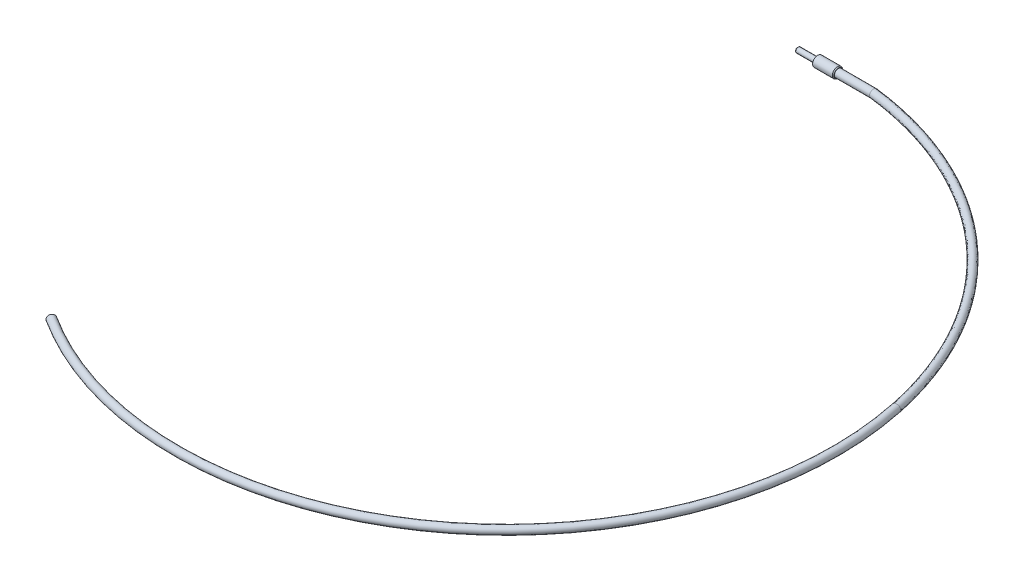
ISO-10303-21;
HEADER;
FILE_DESCRIPTION(('STEP AP214'),'2;1');
FILE_NAME('part.step','',(''),(''),'','','');
FILE_SCHEMA(('AUTOMOTIVE_DESIGN { 1 0 10303 214 1 1 1 1 }'));
ENDSEC;
DATA;
#1=APPLICATION_CONTEXT('core data for automotive mechanical design processes');
#2=APPLICATION_PROTOCOL_DEFINITION('international standard','automotive_design',2000,#1);
#3=PRODUCT_CONTEXT('',#1,'mechanical');
#4=PRODUCT('Part','Part','',(#3));
#5=PRODUCT_RELATED_PRODUCT_CATEGORY('part','',(#4));
#6=PRODUCT_DEFINITION_FORMATION('','',#4);
#7=PRODUCT_DEFINITION_CONTEXT('part definition',#1,'design');
#8=PRODUCT_DEFINITION('design','',#6,#7);
#9=PRODUCT_DEFINITION_SHAPE('','',#8);
#10=(LENGTH_UNIT() NAMED_UNIT(*) SI_UNIT(.MILLI.,.METRE.));
#11=(NAMED_UNIT(*) PLANE_ANGLE_UNIT() SI_UNIT($,.RADIAN.));
#12=(NAMED_UNIT(*) SI_UNIT($,.STERADIAN.) SOLID_ANGLE_UNIT());
#13=UNCERTAINTY_MEASURE_WITH_UNIT(LENGTH_MEASURE(1.E-05),#10,'distance_accuracy_value','');
#14=(GEOMETRIC_REPRESENTATION_CONTEXT(3) GLOBAL_UNCERTAINTY_ASSIGNED_CONTEXT((#13)) GLOBAL_UNIT_ASSIGNED_CONTEXT((#10,
#11,#12)) REPRESENTATION_CONTEXT('',''));
#15=CARTESIAN_POINT('',(0.,0.,0.));
#16=DIRECTION('',(0.,0.,1.));
#17=DIRECTION('',(1.,0.,0.));
#18=AXIS2_PLACEMENT_3D('',#15,#16,#17);
#19=CARTESIAN_POINT('',(-111.436989642943,0.,175.047081609406));
#20=DIRECTION('',(-0.842678132396547,0.,-0.538417649395586));
#21=DIRECTION('',(-0.538417649395586,0.,0.842678132396547));
#22=AXIS2_PLACEMENT_3D('',#19,#20,#21);
#23=PLANE('',#22);
#24=CARTESIAN_POINT('',(-111.436989642943,0.,175.047081609406));
#25=DIRECTION('',(-0.842678132396547,0.,-0.538417649395586));
#26=DIRECTION('',(-0.538417649395586,0.,0.842678132396547));
#27=AXIS2_PLACEMENT_3D('',#24,#25,#26);
#28=CIRCLE('',#27,2.413);
#29=CARTESIAN_POINT('',(-112.736191430934,0.,177.080463942879));
#30=VERTEX_POINT('',#29);
#31=EDGE_CURVE('E45',#30,#30,#28,.T.);
#32=ORIENTED_EDGE('',*,*,#31,.T.);
#33=EDGE_LOOP('',(#32));
#34=FACE_BOUND('',#33,.T.);
#35=ADVANCED_FACE('F32',(#34),#23,.T.);
#36=CARTESIAN_POINT('',(-2.0305232857597,0.,3.81488510642766));
#37=DIRECTION('',(0.,-1.,0.));
#38=DIRECTION('',(0.,0.,-1.));
#39=AXIS2_PLACEMENT_3D('',#36,#37,#38);
#40=TOROIDAL_SURFACE('',#39,203.2,2.413);
#41=ORIENTED_EDGE('',*,*,#31,.F.);
#42=EDGE_LOOP('',(#41));
#43=FACE_BOUND('',#42,.T.);
#44=CARTESIAN_POINT('',(196.869297150107,0.,-37.7675803156707));
#45=DIRECTION('',(0.204638117234736,0.,0.978837698995407));
#46=DIRECTION('',(0.978837698995407,0.,-0.204638117234736));
#47=AXIS2_PLACEMENT_3D('',#44,#45,#46);
#48=CIRCLE('',#47,2.413);
#49=CARTESIAN_POINT('',(199.231232517783,0.,-38.2613720925581));
#50=VERTEX_POINT('',#49);
#51=EDGE_CURVE('E63',#50,#50,#48,.T.);
#52=ORIENTED_EDGE('',*,*,#51,.T.);
#53=EDGE_LOOP('',(#52));
#54=FACE_BOUND('',#53,.T.);
#55=ADVANCED_FACE('F133',(#43,#54),#40,.T.);
#56=CARTESIAN_POINT('',(21.857688216756,0.,-201.488777882145));
#57=CARTESIAN_POINT('',(21.9454223642169,0.,-201.477811113712));
#58=CARTESIAN_POINT('',(22.0326396265489,0.,-201.466909065983));
#59=CARTESIAN_POINT('',(24.7619458079161,0.,-201.12574238947));
#60=CARTESIAN_POINT('',(27.4274088712571,0.,-200.740264373094));
#61=CARTESIAN_POINT('',(32.7104806856669,0.,-199.870777582429));
#62=CARTESIAN_POINT('',(35.3435578931917,0.,-199.384838118311));
#63=CARTESIAN_POINT('',(43.2115632831059,0.,-197.774517735688));
#64=CARTESIAN_POINT('',(48.4152551838274,0.,-196.497555292911));
#65=CARTESIAN_POINT('',(63.8544629871432,0.,-192.067953592542));
#66=CARTESIAN_POINT('',(73.9172372669281,0.,-188.315622142871));
#67=CARTESIAN_POINT('',(103.057190673557,0.,-174.794446888511));
#68=CARTESIAN_POINT('',(121.072175932676,0.,-162.745837636303));
#69=CARTESIAN_POINT('',(152.571261804763,0.,-133.721684173501));
#70=CARTESIAN_POINT('',(166.050531050647,0.,-116.750591725168));
#71=CARTESIAN_POINT('',(187.190864551694,0.,-79.4990119669768));
#72=CARTESIAN_POINT('',(194.848487659606,0.,-59.2251883660467));
#73=CARTESIAN_POINT('',(199.231232517783,0.,-38.2613720925581));
#74=CARTESIAN_POINT('',(21.857688216756,4.82599999999999,-201.488777882145));
#75=CARTESIAN_POINT('',(21.9454223642169,4.82599999999999,-201.477811113712));
#76=CARTESIAN_POINT('',(22.0326396265489,4.82599999999999,-201.466909065983));
#77=CARTESIAN_POINT('',(24.7619458079161,4.82599999999999,-201.12574238947));
#78=CARTESIAN_POINT('',(27.4274088712572,4.82599999999999,-200.740264373094));
#79=CARTESIAN_POINT('',(32.7104806856669,4.82599999999999,-199.870777582429));
#80=CARTESIAN_POINT('',(35.3435578931917,4.82599999999999,-199.384838118311));
#81=CARTESIAN_POINT('',(43.2115632831059,4.82599999999999,-197.774517735688));
#82=CARTESIAN_POINT('',(48.4152551838274,4.82599999999999,-196.497555292911));
#83=CARTESIAN_POINT('',(63.8544629871432,4.82599999999999,-192.067953592542));
#84=CARTESIAN_POINT('',(73.9172372669281,4.82599999999999,-188.315622142872));
#85=CARTESIAN_POINT('',(103.057190673557,4.82599999999999,-174.794446888511));
#86=CARTESIAN_POINT('',(121.072175932676,4.82599999999999,-162.745837636303));
#87=CARTESIAN_POINT('',(152.571261804763,4.82599999999999,-133.721684173501));
#88=CARTESIAN_POINT('',(166.050531050647,4.82599999999999,-116.750591725168));
#89=CARTESIAN_POINT('',(187.190864551694,4.82599999999999,-79.4990119669768));
#90=CARTESIAN_POINT('',(194.848487659606,4.82599999999999,-59.2251883660467));
#91=CARTESIAN_POINT('',(199.231232517783,4.82599999999999,-38.2613720925581));
#92=CARTESIAN_POINT('',(21.2590965876285,4.82599999999999,-196.700044849125));
#93=CARTESIAN_POINT('',(21.3468307350893,4.82599999999999,-196.689078080692));
#94=CARTESIAN_POINT('',(21.4350817948621,4.82599999999999,-196.678046805719));
#95=CARTESIAN_POINT('',(24.1324161152514,4.82599999999999,-196.34087669112));
#96=CARTESIAN_POINT('',(26.7052170701756,4.82599999999999,-195.968199503903));
#97=CARTESIAN_POINT('',(31.8652348294617,4.82599999999999,-195.118964922456));
#98=CARTESIAN_POINT('',(34.436982030635,4.82599999999999,-194.644344028986));
#99=CARTESIAN_POINT('',(42.1217247273575,4.82599999999999,-193.071531456196));
#100=CARTESIAN_POINT('',(47.2042115011053,4.82599999999999,-191.824312203041));
#101=CARTESIAN_POINT('',(62.2838070948671,4.82599999999999,-187.497885411452));
#102=CARTESIAN_POINT('',(72.1121978143805,4.82599999999999,-183.832953795988));
#103=CARTESIAN_POINT('',(100.573419309134,4.82599999999999,-170.626715666034));
#104=CARTESIAN_POINT('',(118.168796986422,4.82599999999999,-158.858744322591));
#105=CARTESIAN_POINT('',(148.934201699633,4.82599999999999,-130.510625543563));
#106=CARTESIAN_POINT('',(162.099509901831,4.82599999999999,-113.934826177926));
#107=CARTESIAN_POINT('',(182.747439768262,4.82599999999999,-77.5509154790044));
#108=CARTESIAN_POINT('',(190.227093011004,4.82599999999999,-57.7474348561002));
#109=CARTESIAN_POINT('',(194.507361782431,4.82599999999999,-37.2737885387833));
#110=CARTESIAN_POINT('',(21.2590965876285,0.,-196.700044849125));
#111=CARTESIAN_POINT('',(21.3468307350893,0.,-196.689078080692));
#112=CARTESIAN_POINT('',(21.4350817948621,0.,-196.678046805719));
#113=CARTESIAN_POINT('',(24.1324161152514,0.,-196.34087669112));
#114=CARTESIAN_POINT('',(26.7052170701756,0.,-195.968199503903));
#115=CARTESIAN_POINT('',(31.8652348294617,0.,-195.118964922456));
#116=CARTESIAN_POINT('',(34.436982030635,0.,-194.644344028986));
#117=CARTESIAN_POINT('',(42.1217247273575,0.,-193.071531456196));
#118=CARTESIAN_POINT('',(47.2042115011053,0.,-191.824312203041));
#119=CARTESIAN_POINT('',(62.2838070948671,0.,-187.497885411452));
#120=CARTESIAN_POINT('',(72.1121978143805,0.,-183.832953795988));
#121=CARTESIAN_POINT('',(100.573419309134,0.,-170.626715666034));
#122=CARTESIAN_POINT('',(118.168796986422,0.,-158.858744322591));
#123=CARTESIAN_POINT('',(148.934201699633,0.,-130.510625543563));
#124=CARTESIAN_POINT('',(162.099509901831,0.,-113.934826177926));
#125=CARTESIAN_POINT('',(182.747439768262,0.,-77.5509154790044));
#126=CARTESIAN_POINT('',(190.227093011004,0.,-57.7474348561002));
#127=CARTESIAN_POINT('',(194.507361782431,0.,-37.2737885387833));
#128=CARTESIAN_POINT('',(21.2590965876285,-4.82599999999999,-196.700044849125));
#129=CARTESIAN_POINT('',(21.3468307350893,-4.82599999999999,-196.689078080692));
#130=CARTESIAN_POINT('',(21.4350817948621,-4.82599999999999,-196.678046805719));
#131=CARTESIAN_POINT('',(24.1324161152514,-4.82599999999999,-196.34087669112));
#132=CARTESIAN_POINT('',(26.7052170701756,-4.82599999999999,-195.968199503903));
#133=CARTESIAN_POINT('',(31.8652348294617,-4.82599999999999,-195.118964922456));
#134=CARTESIAN_POINT('',(34.436982030635,-4.82599999999999,-194.644344028986));
#135=CARTESIAN_POINT('',(42.1217247273575,-4.82599999999999,-193.071531456196));
#136=CARTESIAN_POINT('',(47.2042115011053,-4.82599999999999,-191.824312203041));
#137=CARTESIAN_POINT('',(62.2838070948671,-4.82599999999999,-187.497885411452));
#138=CARTESIAN_POINT('',(72.1121978143805,-4.82599999999999,-183.832953795988));
#139=CARTESIAN_POINT('',(100.573419309134,-4.82599999999999,-170.626715666034));
#140=CARTESIAN_POINT('',(118.168796986422,-4.82599999999999,-158.858744322591));
#141=CARTESIAN_POINT('',(148.934201699633,-4.82599999999999,-130.510625543563));
#142=CARTESIAN_POINT('',(162.099509901831,-4.82599999999999,-113.934826177926));
#143=CARTESIAN_POINT('',(182.747439768262,-4.82599999999999,-77.5509154790044));
#144=CARTESIAN_POINT('',(190.227093011004,-4.82599999999999,-57.7474348561002));
#145=CARTESIAN_POINT('',(194.507361782431,-4.82599999999999,-37.2737885387833));
#146=CARTESIAN_POINT('',(21.857688216756,-4.82599999999999,-201.488777882145));
#147=CARTESIAN_POINT('',(21.9454223642169,-4.82599999999999,-201.477811113712));
#148=CARTESIAN_POINT('',(22.0326396265489,-4.82599999999999,-201.466909065983));
#149=CARTESIAN_POINT('',(24.7619458079161,-4.82599999999999,-201.12574238947));
#150=CARTESIAN_POINT('',(27.4274088712572,-4.82599999999999,-200.740264373094));
#151=CARTESIAN_POINT('',(32.7104806856669,-4.82599999999999,-199.870777582429));
#152=CARTESIAN_POINT('',(35.3435578931917,-4.82599999999999,-199.384838118311));
#153=CARTESIAN_POINT('',(43.2115632831059,-4.82599999999999,-197.774517735688));
#154=CARTESIAN_POINT('',(48.4152551838274,-4.82599999999999,-196.497555292911));
#155=CARTESIAN_POINT('',(63.8544629871432,-4.82599999999999,-192.067953592542));
#156=CARTESIAN_POINT('',(73.9172372669281,-4.82599999999999,-188.315622142872));
#157=CARTESIAN_POINT('',(103.057190673557,-4.82599999999999,-174.794446888511));
#158=CARTESIAN_POINT('',(121.072175932676,-4.82599999999999,-162.745837636303));
#159=CARTESIAN_POINT('',(152.571261804763,-4.82599999999999,-133.721684173501));
#160=CARTESIAN_POINT('',(166.050531050647,-4.82599999999999,-116.750591725168));
#161=CARTESIAN_POINT('',(187.190864551694,-4.82599999999999,-79.4990119669768));
#162=CARTESIAN_POINT('',(194.848487659606,-4.82599999999999,-59.2251883660467));
#163=CARTESIAN_POINT('',(199.231232517783,-4.82599999999999,-38.2613720925581));
#164=CARTESIAN_POINT('',(21.857688216756,0.,-201.488777882145));
#165=CARTESIAN_POINT('',(21.9454223642169,0.,-201.477811113712));
#166=CARTESIAN_POINT('',(22.0326396265489,0.,-201.466909065983));
#167=CARTESIAN_POINT('',(24.7619458079161,0.,-201.12574238947));
#168=CARTESIAN_POINT('',(27.4274088712571,0.,-200.740264373094));
#169=CARTESIAN_POINT('',(32.7104806856669,0.,-199.870777582429));
#170=CARTESIAN_POINT('',(35.3435578931917,0.,-199.384838118311));
#171=CARTESIAN_POINT('',(43.2115632831059,0.,-197.774517735688));
#172=CARTESIAN_POINT('',(48.4152551838274,0.,-196.497555292911));
#173=CARTESIAN_POINT('',(63.8544629871432,0.,-192.067953592542));
#174=CARTESIAN_POINT('',(73.9172372669281,0.,-188.315622142871));
#175=CARTESIAN_POINT('',(103.057190673557,0.,-174.794446888511));
#176=CARTESIAN_POINT('',(121.072175932676,0.,-162.745837636303));
#177=CARTESIAN_POINT('',(152.571261804763,0.,-133.721684173501));
#178=CARTESIAN_POINT('',(166.050531050647,0.,-116.750591725168));
#179=CARTESIAN_POINT('',(187.190864551694,0.,-79.4990119669768));
#180=CARTESIAN_POINT('',(194.848487659606,0.,-59.2251883660467));
#181=CARTESIAN_POINT('',(199.231232517783,0.,-38.2613720925581));
#182=(BOUNDED_SURFACE() B_SPLINE_SURFACE(3,3,((#56,#57,#58,#59,#60,#61,#62,#63,#64,#65,#66,#67,
#68,#69,#70,#71,#72,#73),(#74,#75,#76,#77,#78,#79,#80,#81,#82,#83,#84,#85,#86,#87,#88,#89,#90,
#91),(#92,#93,#94,#95,#96,#97,#98,#99,#100,#101,#102,#103,#104,#105,#106,#107,#108,#109),(#110,
#111,#112,#113,#114,#115,#116,#117,#118,#119,#120,#121,#122,#123,#124,#125,#126,#127),(#128,
#129,#130,#131,#132,#133,#134,#135,#136,#137,#138,#139,#140,#141,#142,#143,#144,#145),(#146,
#147,#148,#149,#150,#151,#152,#153,#154,#155,#156,#157,#158,#159,#160,#161,#162,#163),(#164,
#165,#166,#167,#168,#169,#170,#171,#172,#173,#174,#175,#176,#177,#178,#179,#180,#181)),
.UNSPECIFIED.,.T.,.F.,.F.) B_SPLINE_SURFACE_WITH_KNOTS((4,3,4),(4,2,2,2,2,2,2,2,4),(0.,0.5,1.),
(-0.000363035657997313,0.,0.010864430314376,0.021728860628752,0.043457721257504,
0.086915442515008,0.173830885030016,0.260746327545024,0.347661770060032),
.UNSPECIFIED.) GEOMETRIC_REPRESENTATION_ITEM() RATIONAL_B_SPLINE_SURFACE(((1.,1.,1.,1.,1.,1.,1.,
1.,1.,1.,1.,1.,1.,1.,1.,1.,1.,1.),(0.333333333333333,0.333333333333333,0.333333333333333,
0.333333333333333,0.333333333333333,0.333333333333333,0.333333333333333,0.333333333333333,
0.333333333333333,0.333333333333333,0.333333333333333,0.333333333333333,0.333333333333333,
0.333333333333333,0.333333333333333,0.333333333333333,0.333333333333333,0.333333333333333),
(0.333333333333333,0.333333333333333,0.333333333333333,0.333333333333333,0.333333333333333,
0.333333333333333,0.333333333333333,0.333333333333333,0.333333333333333,0.333333333333333,
0.333333333333333,0.333333333333333,0.333333333333333,0.333333333333333,0.333333333333333,
0.333333333333333,0.333333333333333,0.333333333333333),(1.,1.,1.,1.,1.,1.,1.,1.,1.,1.,1.,1.,1.,
1.,1.,1.,1.,1.),(0.333333333333333,0.333333333333333,0.333333333333333,0.333333333333333,
0.333333333333333,0.333333333333333,0.333333333333333,0.333333333333333,0.333333333333333,
0.333333333333333,0.333333333333333,0.333333333333333,0.333333333333333,0.333333333333333,
0.333333333333333,0.333333333333333,0.333333333333333,0.333333333333333),(0.333333333333333,
0.333333333333333,0.333333333333333,0.333333333333333,0.333333333333333,0.333333333333333,
0.333333333333333,0.333333333333333,0.333333333333333,0.333333333333333,0.333333333333333,
0.333333333333333,0.333333333333333,0.333333333333333,0.333333333333333,0.333333333333333,
0.333333333333333,0.333333333333333),(1.,1.,1.,1.,1.,1.,1.,1.,1.,1.,1.,1.,1.,1.,1.,1.,1.,1.))) REPRESENTATION_ITEM('') SURFACE());
#183=CARTESIAN_POINT('',(21.8215948445754,-2.413,-199.061511060337));
#184=CARTESIAN_POINT('',(21.8221726133122,-2.41300007579044,-199.070791239331));
#185=CARTESIAN_POINT('',(21.8227504195139,-2.41294652283968,-199.080072021288));
#186=CARTESIAN_POINT('',(21.8275496780832,-2.41205653171996,-199.157158210207));
#187=CARTESIAN_POINT('',(21.8317707917232,-2.40841277647273,-199.224958238506));
#188=CARTESIAN_POINT('',(21.8401800780862,-2.39542568336101,-199.360029309107));
#189=CARTESIAN_POINT('',(21.8443682340443,-2.38607961353605,-199.427300082188));
#190=CARTESIAN_POINT('',(21.8526901212724,-2.36172263632853,-199.560967554635));
#191=CARTESIAN_POINT('',(21.8568237189427,-2.34669980858784,-199.627362108325));
#192=CARTESIAN_POINT('',(21.8649996235388,-2.31109408389775,-199.758684979509));
#193=CARTESIAN_POINT('',(21.8690418581679,-2.29050694000557,-199.823612135833));
#194=CARTESIAN_POINT('',(21.8809693755256,-2.22069216369791,-200.015194350558));
#195=CARTESIAN_POINT('',(21.8886775260247,-2.1633462501171,-200.139004394537));
#196=CARTESIAN_POINT('',(21.9033846321844,-2.02859403643052,-200.375233449163));
#197=CARTESIAN_POINT('',(21.9103835589069,-1.95118691823019,-200.487651995004));
#198=CARTESIAN_POINT('',(21.9201939986412,-1.82182306996847,-200.645229878576));
#199=CARTESIAN_POINT('',(21.9233500456784,-1.77648259578052,-200.695923160323));
#200=CARTESIAN_POINT('',(21.929411040741,-1.68171412902003,-200.793276529478));
#201=CARTESIAN_POINT('',(21.9323162282535,-1.63229012509314,-200.839940463567));
#202=CARTESIAN_POINT('',(21.9378584010029,-1.52964664129394,-200.928960410726));
#203=CARTESIAN_POINT('',(21.9404952540432,-1.47642531239836,-200.971314300423));
#204=CARTESIAN_POINT('',(21.9454805445517,-1.3665940261377,-201.051389479563));
#205=CARTESIAN_POINT('',(21.9478289154377,-1.30998329095727,-201.089109699542));
#206=CARTESIAN_POINT('',(21.9544049914951,-1.13590147811432,-201.194736569526));
#207=CARTESIAN_POINT('',(21.9581799390125,-1.01387868829978,-201.255370906695));
#208=CARTESIAN_POINT('',(21.9643984813139,-0.761420780460169,-201.355255006051));
#209=CARTESIAN_POINT('',(21.9668421165956,-0.630985918459584,-201.394505418722));
#210=CARTESIAN_POINT('',(21.9703284164188,-0.365566860879204,-201.450503428363));
#211=CARTESIAN_POINT('',(21.9713734371124,-0.230590710052599,-201.467288870561));
#212=CARTESIAN_POINT('',(21.9720389730186,0.040267884088327,-201.477978911827));
#213=CARTESIAN_POINT('',(21.971659495648,0.176150322680352,-201.471883630025));
#214=CARTESIAN_POINT('',(21.9694889371748,0.444832262798712,-201.43701945696));
#215=CARTESIAN_POINT('',(21.9676990034773,0.577634179966963,-201.408268995667));
#216=CARTESIAN_POINT('',(21.9627571152187,0.836582457967254,-201.328890888479));
#217=CARTESIAN_POINT('',(21.9596051427362,0.962728731202059,-201.278262954727));
#218=CARTESIAN_POINT('',(21.9539292386471,1.14414615570345,-201.187094891228));
#219=CARTESIAN_POINT('',(21.9518774160131,1.20335908151213,-201.15413790746));
#220=CARTESIAN_POINT('',(21.9474715656278,1.31879952025272,-201.083369842156));
#221=CARTESIAN_POINT('',(21.9451176075149,1.37502771691887,-201.045559879171));
#222=CARTESIAN_POINT('',(21.9401251661127,1.48407187782012,-200.965369841735));
#223=CARTESIAN_POINT('',(21.9374868109866,1.53688936207092,-200.922991825871));
#224=CARTESIAN_POINT('',(21.9319418606042,1.63881037519193,-200.833927265393));
#225=CARTESIAN_POINT('',(21.9290350102615,1.68791028988103,-200.787236623528));
#226=CARTESIAN_POINT('',(21.9199272720592,1.82930285715371,-200.640945631553));
#227=CARTESIAN_POINT('',(21.9133499656703,1.91545350100192,-200.535299184227));
#228=CARTESIAN_POINT('',(21.8993891409606,2.0687312553064,-200.311056890922));
#229=CARTESIAN_POINT('',(21.8920056302779,2.1358585459708,-200.192461167626));
#230=CARTESIAN_POINT('',(21.8804866028746,2.22090613179358,-200.007439992263));
#231=CARTESIAN_POINT('',(21.8765681391602,2.24666897359922,-199.94450079224));
#232=CARTESIAN_POINT('',(21.8686127701516,2.29277823896455,-199.81672003979));
#233=CARTESIAN_POINT('',(21.8645759697917,2.31312930916542,-199.751880172771));
#234=CARTESIAN_POINT('',(21.856417159649,2.34826008402478,-199.620831882063));
#235=CARTESIAN_POINT('',(21.8522953006293,2.36304888006125,-199.554625879807));
#236=CARTESIAN_POINT('',(21.8439896400293,2.38700051536486,-199.421219048404));
#237=CARTESIAN_POINT('',(21.8398058469337,2.39616411808538,-199.354018355524));
#238=CARTESIAN_POINT('',(21.8315236218885,2.40862410670891,-199.220988167392));
#239=CARTESIAN_POINT('',(21.827426133699,2.41207950334499,-199.155173827703));
#240=CARTESIAN_POINT('',(21.8227504216705,2.41294651382003,-199.080072055983));
#241=CARTESIAN_POINT('',(21.8221726156226,2.41300006577571,-199.07079127647));
#242=CARTESIAN_POINT('',(21.8215948445755,2.413,-199.061511060337));
#243=B_SPLINE_CURVE_WITH_KNOTS('',3,(#183,#184,#185,#186,#187,#188,#189,#190,#191,#192,#193,
#194,#195,#196,#197,#198,#199,#200,#201,#202,#203,#204,#205,#206,#207,#208,#209,#210,#211,#212,
#213,#214,#215,#216,#217,#218,#219,#220,#221,#222,#223,#224,#225,#226,#227,#228,#229,#230,#231,
#232,#233,#234,#235,#236,#237,#238,#239,#240,#241,#242),.UNSPECIFIED.,.F.,.F.,(4,2,2,2,2,2,2,2,
2,2,2,2,2,2,2,2,2,2,2,2,2,2,2,2,2,2,2,2,2,4),(0.,0.0278960090124024,0.23170685659396,
0.43561542605208,0.63995457464234,0.844450126880262,1.25237258480646,1.66031168040084,
1.86436235531042,2.06821602512448,2.27216964344908,2.47617024665836,2.88298700794136,
3.28979139344517,3.69590959666061,4.10202568541006,4.50781173968067,4.91360313331044,
5.1167987495761,5.31994761562581,5.52300531261277,5.72625795070183,6.13362765543929,
6.54099350103639,6.74515296632258,6.94913656656272,7.15278529741573,7.35640638287083,
7.55425328251183,7.58214929152408),.UNSPECIFIED.);
#244=CARTESIAN_POINT('',(21.8215948445755,2.413,-199.061511060337));
#245=VERTEX_POINT('',#244);
#246=CARTESIAN_POINT('',(21.8215948445754,-2.413,-199.061511060337));
#247=VERTEX_POINT('',#246);
#248=EDGE_CURVE('E54',#245,#247,#243,.F.);
#249=CARTESIAN_POINT('',(21.8215948445754,-2.413,-199.061511060337));
#250=CARTESIAN_POINT('',(21.8210170759152,-2.41300007579085,-199.052230881337));
#251=CARTESIAN_POINT('',(21.8204392499885,-2.41294652284025,-199.04295010061));
#252=CARTESIAN_POINT('',(21.8156396006509,-2.41205652040798,-198.96586292211));
#253=CARTESIAN_POINT('',(21.8114170814561,-2.40841267080651,-198.898061967438));
#254=CARTESIAN_POINT('',(21.8030029159387,-2.39542525667728,-198.762989190585));
#255=CARTESIAN_POINT('',(21.7988112853902,-2.38607895999013,-198.695717637711));
#256=CARTESIAN_POINT('',(21.790480469705,-2.3617214274502,-198.562048747322));
#257=CARTESIAN_POINT('',(21.7863414140109,-2.34669827045815,-198.495653555905));
#258=CARTESIAN_POINT('',(21.778152772622,-2.31109181347234,-198.364329552473));
#259=CARTESIAN_POINT('',(21.7741032578323,-2.29050426654784,-198.299401901721));
#260=CARTESIAN_POINT('',(21.7621515006036,-2.2206882329367,-198.107818469602));
#261=CARTESIAN_POINT('',(21.7544239610724,-2.16334140147952,-197.98400789037));
#262=CARTESIAN_POINT('',(21.7396737686885,-2.02858724174148,-197.747778095965));
#263=CARTESIAN_POINT('',(21.7326511446082,-1.95117909508302,-197.635359345767));
#264=CARTESIAN_POINT('',(21.722803947757,-1.82181324417606,-197.477780900433));
#265=CARTESIAN_POINT('',(21.7196354331112,-1.776471826962,-197.427087216256));
#266=CARTESIAN_POINT('',(21.7135494673333,-1.68170135729675,-197.329733151406));
#267=CARTESIAN_POINT('',(21.7106317767613,-1.63227629358429,-197.283068923968));
#268=CARTESIAN_POINT('',(21.7050649020066,-1.52963056836044,-197.194048508278));
#269=CARTESIAN_POINT('',(21.702415850167,-1.47640805784512,-197.151694443365));
#270=CARTESIAN_POINT('',(21.6974068179309,-1.3665742865513,-197.071619048102));
#271=CARTESIAN_POINT('',(21.6950469042659,-1.30996224796018,-197.033898787203));
#272=CARTESIAN_POINT('',(21.6884377793604,-1.13587744538372,-196.928272690645));
#273=CARTESIAN_POINT('',(21.6846427766141,-1.0138529020282,-196.867639213593));
#274=CARTESIAN_POINT('',(21.6783903478563,-0.761391296468791,-196.767757250444));
#275=CARTESIAN_POINT('',(21.6759328809842,-0.630954491388477,-196.728508111074));
#276=CARTESIAN_POINT('',(21.6724267513341,-0.365534379345711,-196.67251379585));
#277=CARTESIAN_POINT('',(21.6713756895152,-0.230559218229189,-196.655730298165));
#278=CARTESIAN_POINT('',(21.6707064631473,0.0402971265630856,-196.645043764136));
#279=CARTESIAN_POINT('',(21.6710882910029,0.176178305432444,-196.651140606509));
#280=CARTESIAN_POINT('',(21.6732716589085,0.444855634320247,-196.686007211495));
#281=CARTESIAN_POINT('',(21.6750720264641,0.577654238961123,-196.714758249277));
#282=CARTESIAN_POINT('',(21.6800417059538,0.836595784482051,-196.794136340596));
#283=CARTESIAN_POINT('',(21.6832110359281,0.962738637627877,-196.844763682418));
#284=CARTESIAN_POINT('',(21.6889166849354,1.14415151246166,-196.935930153366));
#285=CARTESIAN_POINT('',(21.6909790590759,1.20336321941683,-196.968886636338));
#286=CARTESIAN_POINT('',(21.6954069484343,1.31880126317791,-197.039653460318));
#287=CARTESIAN_POINT('',(21.6977723937993,1.37502828369365,-197.077462682855));
#288=CARTESIAN_POINT('',(21.7027884181853,1.48407018514566,-197.157651009621));
#289=CARTESIAN_POINT('',(21.7054388688097,1.53688658556313,-197.20002805604));
#290=CARTESIAN_POINT('',(21.7110082899402,1.63880555753045,-197.289090457437));
#291=CARTESIAN_POINT('',(21.7139275157892,1.68790451503383,-197.335779909441));
#292=CARTESIAN_POINT('',(21.7230725488711,1.82929782304196,-197.482070506456));
#293=CARTESIAN_POINT('',(21.7296747084172,1.91544984206472,-197.587718025974));
#294=CARTESIAN_POINT('',(21.7436821905522,2.0687299204271,-197.811962834383));
#295=CARTESIAN_POINT('',(21.7510875055975,2.13585815842679,-197.930560001645));
#296=CARTESIAN_POINT('',(21.7626351340556,2.22090682791881,-198.11558369724));
#297=CARTESIAN_POINT('',(21.7665624555499,2.24666997670113,-198.178523804413));
#298=CARTESIAN_POINT('',(21.7745339193185,2.29277972232584,-198.30630649491));
#299=CARTESIAN_POINT('',(21.7785779580466,2.31313096598057,-198.371147392697));
#300=CARTESIAN_POINT('',(21.7867494118162,2.34826193047483,-198.502197861198));
#301=CARTESIAN_POINT('',(21.7908766790676,2.3630507439101,-198.568405010009));
#302=CARTESIAN_POINT('',(21.7991911871421,2.38700223454513,-198.701814260112));
#303=CARTESIAN_POINT('',(21.8033784197447,2.39616567551258,-198.769016225065));
#304=CARTESIAN_POINT('',(21.8116650197791,2.40862458609186,-198.902043120379));
#305=CARTESIAN_POINT('',(21.8157634985631,2.41207955610301,-198.967852846048));
#306=CARTESIAN_POINT('',(21.8204392478174,2.41294651380568,-199.042950065834));
#307=CARTESIAN_POINT('',(21.8210170735908,2.41300006575982,-199.052230844112));
#308=CARTESIAN_POINT('',(21.8215948445755,2.413,-199.061511060337));
#309=B_SPLINE_CURVE_WITH_KNOTS('',3,(#249,#250,#251,#252,#253,#254,#255,#256,#257,#258,#259,
#260,#261,#262,#263,#264,#265,#266,#267,#268,#269,#270,#271,#272,#273,#274,#275,#276,#277,#278,
#279,#280,#281,#282,#283,#284,#285,#286,#287,#288,#289,#290,#291,#292,#293,#294,#295,#296,#297,
#298,#299,#300,#301,#302,#303,#304,#305,#306,#307,#308),.UNSPECIFIED.,.F.,.F.,(4,2,2,2,2,2,2,2,
2,2,2,2,2,2,2,2,2,2,2,2,2,2,2,2,2,2,2,2,2,4),(0.,0.0278960090122025,0.231709892437916,
0.435621504044034,0.639963721780186,0.844462342990739,1.25239069780016,1.66033569618406,
1.86439088409122,2.06824906355213,2.2722071894464,2.47621229940173,2.88303420168061,
3.28984367520094,3.69595832611679,4.10207082431899,4.50784800178511,4.91363052675523,
5.11682318867721,5.31996910206971,5.52302387752091,5.7262735906213,6.13365193485394,
6.54102645310411,6.745190306548,6.94917828902938,7.15283135935305,7.35645677318734,
7.55429005224715,7.58218606125927),.UNSPECIFIED.);
#310=EDGE_CURVE('E51',#245,#247,#309,.F.);
#311=ORIENTED_EDGE('',*,*,#248,.F.);
#312=ORIENTED_EDGE('',*,*,#310,.T.);
#313=EDGE_LOOP('',(#311,#312));
#314=FACE_BOUND('',#313,.T.);
#315=ORIENTED_EDGE('',*,*,#51,.F.);
#316=EDGE_LOOP('',(#315));
#317=FACE_BOUND('',#316,.T.);
#318=ADVANCED_FACE('F55',(#314,#317),#182,.T.);
#319=CARTESIAN_POINT('',(0.,0.,-199.061511060337));
#320=DIRECTION('',(1.,0.,0.));
#321=DIRECTION('',(0.,0.,-1.));
#322=AXIS2_PLACEMENT_3D('',#319,#320,#321);
#323=CYLINDRICAL_SURFACE('',#322,2.413);
#324=ORIENTED_EDGE('',*,*,#310,.F.);
#325=ORIENTED_EDGE('',*,*,#248,.T.);
#326=EDGE_LOOP('',(#324,#325));
#327=FACE_BOUND('',#326,.T.);
#328=CARTESIAN_POINT('',(0.,0.,-199.061511060337));
#329=DIRECTION('',(1.,0.,0.));
#330=DIRECTION('',(0.,0.,-1.));
#331=AXIS2_PLACEMENT_3D('',#328,#329,#330);
#332=CIRCLE('',#331,2.413);
#333=CARTESIAN_POINT('',(0.,0.,-201.474511060337));
#334=VERTEX_POINT('',#333);
#335=EDGE_CURVE('E72',#334,#334,#332,.T.);
#336=ORIENTED_EDGE('',*,*,#335,.T.);
#337=EDGE_LOOP('',(#336));
#338=FACE_BOUND('',#337,.T.);
#339=ADVANCED_FACE('F60',(#327,#338),#323,.T.);
#340=CARTESIAN_POINT('',(-12.7,0.,-199.061511060337));
#341=DIRECTION('',(1.,0.,0.));
#342=DIRECTION('',(0.,0.,-1.));
#343=AXIS2_PLACEMENT_3D('',#340,#341,#342);
#344=CYLINDRICAL_SURFACE('',#343,3.175);
#345=CARTESIAN_POINT('',(-0.508000000000012,0.,-199.061511060337));
#346=DIRECTION('',(1.,0.,0.));
#347=DIRECTION('',(0.,0.,-1.));
#348=AXIS2_PLACEMENT_3D('',#345,#346,#347);
#349=CIRCLE('',#348,3.175);
#350=CARTESIAN_POINT('',(-0.508000000000012,0.,-202.236511060337));
#351=VERTEX_POINT('',#350);
#352=EDGE_CURVE('E116',#351,#351,#349,.F.);
#353=ORIENTED_EDGE('',*,*,#352,.T.);
#354=EDGE_LOOP('',(#353));
#355=FACE_BOUND('',#354,.T.);
#356=CARTESIAN_POINT('',(-12.7,0.,-199.061511060337));
#357=DIRECTION('',(1.,0.,0.));
#358=DIRECTION('',(0.,0.,-1.));
#359=AXIS2_PLACEMENT_3D('',#356,#357,#358);
#360=CIRCLE('',#359,3.175);
#361=CARTESIAN_POINT('',(-12.7,0.,-202.236511060337));
#362=VERTEX_POINT('',#361);
#363=EDGE_CURVE('E126',#362,#362,#360,.T.);
#364=ORIENTED_EDGE('',*,*,#363,.T.);
#365=EDGE_LOOP('',(#364));
#366=FACE_BOUND('',#365,.T.);
#367=ADVANCED_FACE('F86',(#355,#366),#344,.T.);
#368=CARTESIAN_POINT('',(-12.7,0.,-199.061511060337));
#369=DIRECTION('',(1.,0.,0.));
#370=DIRECTION('',(0.,0.,-1.));
#371=AXIS2_PLACEMENT_3D('',#368,#369,#370);
#372=PLANE('',#371);
#373=CARTESIAN_POINT('',(-12.7,0.,-199.061511060337));
#374=DIRECTION('',(-1.,0.,0.));
#375=DIRECTION('',(0.,0.,1.));
#376=AXIS2_PLACEMENT_3D('',#373,#374,#375);
#377=CIRCLE('',#376,1.58750000000004);
#378=CARTESIAN_POINT('',(-12.7,0.,-197.474011060337));
#379=VERTEX_POINT('',#378);
#380=EDGE_CURVE('E114',#379,#379,#377,.T.);
#381=ORIENTED_EDGE('',*,*,#380,.F.);
#382=EDGE_LOOP('',(#381));
#383=FACE_BOUND('',#382,.T.);
#384=ORIENTED_EDGE('',*,*,#363,.F.);
#385=EDGE_LOOP('',(#384));
#386=FACE_BOUND('',#385,.T.);
#387=ADVANCED_FACE('F90',(#383,#386),#372,.F.);
#388=CARTESIAN_POINT('',(0.,0.,-199.061511060337));
#389=DIRECTION('',(1.,0.,0.));
#390=DIRECTION('',(0.,0.,-1.));
#391=AXIS2_PLACEMENT_3D('',#388,#389,#390);
#392=PLANE('',#391);
#393=CARTESIAN_POINT('',(0.,0.,-199.061511060337));
#394=DIRECTION('',(1.,0.,0.));
#395=DIRECTION('',(0.,0.,-1.));
#396=AXIS2_PLACEMENT_3D('',#393,#394,#395);
#397=CIRCLE('',#396,2.66699999999997);
#398=CARTESIAN_POINT('',(0.,0.,-201.728511060337));
#399=VERTEX_POINT('',#398);
#400=EDGE_CURVE('E58',#399,#399,#397,.T.);
#401=ORIENTED_EDGE('',*,*,#400,.T.);
#402=EDGE_LOOP('',(#401));
#403=FACE_BOUND('',#402,.T.);
#404=ORIENTED_EDGE('',*,*,#335,.F.);
#405=EDGE_LOOP('',(#404));
#406=FACE_BOUND('',#405,.T.);
#407=ADVANCED_FACE('F92',(#403,#406),#392,.T.);
#408=CARTESIAN_POINT('',(0.,0.,-199.061511060337));
#409=DIRECTION('',(-1.,0.,0.));
#410=DIRECTION('',(0.,0.,1.));
#411=AXIS2_PLACEMENT_3D('',#408,#409,#410);
#412=CONICAL_SURFACE('',#411,2.66699999999997,0.785398163397458);
#413=ORIENTED_EDGE('',*,*,#352,.F.);
#414=EDGE_LOOP('',(#413));
#415=FACE_BOUND('',#414,.T.);
#416=ORIENTED_EDGE('',*,*,#400,.F.);
#417=EDGE_LOOP('',(#416));
#418=FACE_BOUND('',#417,.T.);
#419=ADVANCED_FACE('F95',(#415,#418),#412,.T.);
#420=CARTESIAN_POINT('',(-25.4,0.,-199.061511060337));
#421=DIRECTION('',(1.,0.,0.));
#422=DIRECTION('',(0.,0.,-1.));
#423=AXIS2_PLACEMENT_3D('',#420,#421,#422);
#424=CYLINDRICAL_SURFACE('',#423,1.58750000000004);
#425=CARTESIAN_POINT('',(-24.6888000000001,0.,-199.061511060337));
#426=DIRECTION('',(-1.,0.,0.));
#427=DIRECTION('',(0.,0.,1.));
#428=AXIS2_PLACEMENT_3D('',#425,#426,#427);
#429=CIRCLE('',#428,1.58750000000004);
#430=CARTESIAN_POINT('',(-24.6888000000001,0.,-197.474011060337));
#431=VERTEX_POINT('',#430);
#432=EDGE_CURVE('E11',#431,#431,#429,.F.);
#433=ORIENTED_EDGE('',*,*,#432,.T.);
#434=EDGE_LOOP('',(#433));
#435=FACE_BOUND('',#434,.T.);
#436=ORIENTED_EDGE('',*,*,#380,.T.);
#437=EDGE_LOOP('',(#436));
#438=FACE_BOUND('',#437,.T.);
#439=ADVANCED_FACE('F100',(#435,#438),#424,.T.);
#440=CARTESIAN_POINT('',(-25.4,0.,-199.061511060337));
#441=DIRECTION('',(-1.,0.,0.));
#442=DIRECTION('',(0.,0.,1.));
#443=AXIS2_PLACEMENT_3D('',#440,#441,#442);
#444=PLANE('',#443);
#445=CARTESIAN_POINT('',(-25.4,0.,-199.061511060337));
#446=DIRECTION('',(-1.,0.,0.));
#447=DIRECTION('',(0.,0.,1.));
#448=AXIS2_PLACEMENT_3D('',#445,#446,#447);
#449=CIRCLE('',#448,0.876300000000108);
#450=CARTESIAN_POINT('',(-25.4,0.,-198.185211060337));
#451=VERTEX_POINT('',#450);
#452=EDGE_CURVE('E40',#451,#451,#449,.T.);
#453=ORIENTED_EDGE('',*,*,#452,.T.);
#454=EDGE_LOOP('',(#453));
#455=FACE_BOUND('',#454,.T.);
#456=ADVANCED_FACE('F103',(#455),#444,.T.);
#457=CARTESIAN_POINT('',(-25.4,0.,-199.061511060337));
#458=DIRECTION('',(1.,0.,0.));
#459=DIRECTION('',(0.,0.,-1.));
#460=AXIS2_PLACEMENT_3D('',#457,#458,#459);
#461=CONICAL_SURFACE('',#460,0.876300000000108,0.785398163397452);
#462=ORIENTED_EDGE('',*,*,#432,.F.);
#463=EDGE_LOOP('',(#462));
#464=FACE_BOUND('',#463,.T.);
#465=ORIENTED_EDGE('',*,*,#452,.F.);
#466=EDGE_LOOP('',(#465));
#467=FACE_BOUND('',#466,.T.);
#468=ADVANCED_FACE('F34',(#464,#467),#461,.T.);
#469=CLOSED_SHELL('',(#35,#55,#318,#339,#367,#387,#407,#419,#439,#456,#468));
#470=MANIFOLD_SOLID_BREP('B2',#469);
#471=ADVANCED_BREP_SHAPE_REPRESENTATION('',(#18,#470),#14);
#472=SHAPE_DEFINITION_REPRESENTATION(#9,#471);
ENDSEC;
END-ISO-10303-21;
